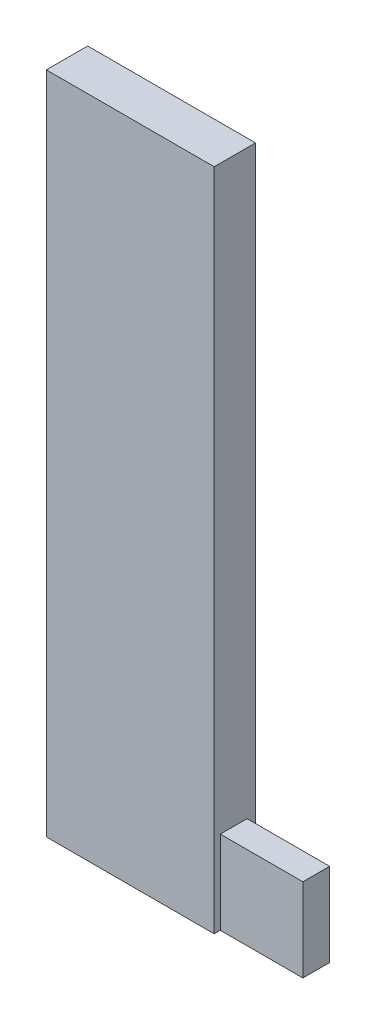
ISO-10303-21;
HEADER;
FILE_DESCRIPTION(('STEP AP214'),'2;1');
FILE_NAME('part.step','',(''),(''),'','','');
FILE_SCHEMA(('AUTOMOTIVE_DESIGN { 1 0 10303 214 1 1 1 1 }'));
ENDSEC;
DATA;
#1=APPLICATION_CONTEXT('core data for automotive mechanical design processes');
#2=APPLICATION_PROTOCOL_DEFINITION('international standard','automotive_design',2000,#1);
#3=PRODUCT_CONTEXT('',#1,'mechanical');
#4=PRODUCT('Part','Part','',(#3));
#5=PRODUCT_RELATED_PRODUCT_CATEGORY('part','',(#4));
#6=PRODUCT_DEFINITION_FORMATION('','',#4);
#7=PRODUCT_DEFINITION_CONTEXT('part definition',#1,'design');
#8=PRODUCT_DEFINITION('design','',#6,#7);
#9=PRODUCT_DEFINITION_SHAPE('','',#8);
#10=(LENGTH_UNIT() NAMED_UNIT(*) SI_UNIT(.MILLI.,.METRE.));
#11=(NAMED_UNIT(*) PLANE_ANGLE_UNIT() SI_UNIT($,.RADIAN.));
#12=(NAMED_UNIT(*) SI_UNIT($,.STERADIAN.) SOLID_ANGLE_UNIT());
#13=UNCERTAINTY_MEASURE_WITH_UNIT(LENGTH_MEASURE(1.E-05),#10,'distance_accuracy_value','');
#14=(GEOMETRIC_REPRESENTATION_CONTEXT(3) GLOBAL_UNCERTAINTY_ASSIGNED_CONTEXT((#13)) GLOBAL_UNIT_ASSIGNED_CONTEXT((#10,
#11,#12)) REPRESENTATION_CONTEXT('',''));
#15=CARTESIAN_POINT('',(0.,0.,0.));
#16=DIRECTION('',(0.,0.,1.));
#17=DIRECTION('',(1.,0.,0.));
#18=AXIS2_PLACEMENT_3D('',#15,#16,#17);
#19=CARTESIAN_POINT('',(-37.5648019739697,-2.3820263364277,1.27));
#20=DIRECTION('',(0.,1.,0.));
#21=DIRECTION('',(0.,0.,1.));
#22=AXIS2_PLACEMENT_3D('',#19,#20,#21);
#23=PLANE('',#22);
#24=DIRECTION('',(1.,0.,0.));
#25=VECTOR('',#24,1.);
#26=CARTESIAN_POINT('',(-37.5648019739697,-2.3820263364277,0.));
#27=LINE('',#26,#25);
#28=CARTESIAN_POINT('',(-37.5648019739697,-2.3820263364277,0.));
#29=VERTEX_POINT('',#28);
#30=CARTESIAN_POINT('',(-32.4024186657096,-2.3820263364277,0.));
#31=VERTEX_POINT('',#30);
#32=EDGE_CURVE('E191',#29,#31,#27,.T.);
#33=ORIENTED_EDGE('',*,*,#32,.T.);
#34=DIRECTION('',(0.,0.,-1.));
#35=VECTOR('',#34,1.);
#36=CARTESIAN_POINT('',(-32.4024186657096,-2.3820263364277,1.27));
#37=LINE('',#36,#35);
#38=CARTESIAN_POINT('',(-32.4024186657096,-2.3820263364277,0.259253936790594));
#39=VERTEX_POINT('',#38);
#40=EDGE_CURVE('E47',#39,#31,#37,.T.);
#41=ORIENTED_EDGE('',*,*,#40,.F.);
#42=DIRECTION('',(-1.,0.,0.));
#43=VECTOR('',#42,1.);
#44=CARTESIAN_POINT('',(-29.8624186657096,-2.3820263364277,0.259253936790594));
#45=LINE('',#44,#43);
#46=CARTESIAN_POINT('',(-29.8624186657096,-2.3820263364277,0.259253936790594));
#47=VERTEX_POINT('',#46);
#48=EDGE_CURVE('E130',#47,#39,#45,.T.);
#49=ORIENTED_EDGE('',*,*,#48,.F.);
#50=DIRECTION('',(0.,0.,-1.));
#51=VECTOR('',#50,1.);
#52=CARTESIAN_POINT('',(-29.8624186657096,-2.3820263364277,0.259253936790594));
#53=LINE('',#52,#51);
#54=CARTESIAN_POINT('',(-29.8624186657096,-2.3820263364277,1.0822686477362));
#55=VERTEX_POINT('',#54);
#56=EDGE_CURVE('E137',#55,#47,#53,.T.);
#57=ORIENTED_EDGE('',*,*,#56,.F.);
#58=DIRECTION('',(-1.,0.,0.));
#59=VECTOR('',#58,1.);
#60=CARTESIAN_POINT('',(-29.8624186657096,-2.3820263364277,1.0822686477362));
#61=LINE('',#60,#59);
#62=CARTESIAN_POINT('',(-32.4024186657096,-2.3820263364277,1.0822686477362));
#63=VERTEX_POINT('',#62);
#64=EDGE_CURVE('E259',#55,#63,#61,.T.);
#65=ORIENTED_EDGE('',*,*,#64,.T.);
#66=CARTESIAN_POINT('',(-32.4024186657096,-2.3820263364277,1.27));
#67=VERTEX_POINT('',#66);
#68=EDGE_CURVE('E11',#67,#63,#37,.T.);
#69=ORIENTED_EDGE('',*,*,#68,.F.);
#70=DIRECTION('',(1.,0.,0.));
#71=VECTOR('',#70,1.);
#72=CARTESIAN_POINT('',(-37.5648019739697,-2.3820263364277,1.27));
#73=LINE('',#72,#71);
#74=CARTESIAN_POINT('',(-37.5648019739697,-2.3820263364277,1.27));
#75=VERTEX_POINT('',#74);
#76=EDGE_CURVE('E201',#75,#67,#73,.T.);
#77=ORIENTED_EDGE('',*,*,#76,.F.);
#78=DIRECTION('',(0.,0.,-1.));
#79=VECTOR('',#78,1.);
#80=CARTESIAN_POINT('',(-37.5648019739697,-2.3820263364277,1.27));
#81=LINE('',#80,#79);
#82=EDGE_CURVE('E216',#75,#29,#81,.T.);
#83=ORIENTED_EDGE('',*,*,#82,.T.);
#84=EDGE_LOOP('',(#33,#41,#49,#57,#65,#69,#77,#83));
#85=FACE_BOUND('',#84,.T.);
#86=ADVANCED_FACE('F39',(#85),#23,.F.);
#87=CARTESIAN_POINT('',(-32.4024186657096,18.0530258479316,1.27));
#88=DIRECTION('',(1.,0.,0.));
#89=DIRECTION('',(0.,0.,-1.));
#90=AXIS2_PLACEMENT_3D('',#87,#88,#89);
#91=PLANE('',#90);
#92=DIRECTION('',(0.,-1.,0.));
#93=VECTOR('',#92,1.);
#94=CARTESIAN_POINT('',(-32.4024186657096,-2.3820263364277,1.0822686477362));
#95=LINE('',#94,#93);
#96=CARTESIAN_POINT('',(-32.4024186657096,0.181462943957815,1.0822686477362));
#97=VERTEX_POINT('',#96);
#98=EDGE_CURVE('E53',#97,#63,#95,.T.);
#99=ORIENTED_EDGE('',*,*,#98,.F.);
#100=DIRECTION('',(0.,0.,1.));
#101=VECTOR('',#100,1.);
#102=CARTESIAN_POINT('',(-32.4024186657096,0.181462943957815,1.0822686477362));
#103=LINE('',#102,#101);
#104=CARTESIAN_POINT('',(-32.4024186657096,0.181462943957815,0.259253936790594));
#105=VERTEX_POINT('',#104);
#106=EDGE_CURVE('E262',#105,#97,#103,.T.);
#107=ORIENTED_EDGE('',*,*,#106,.F.);
#108=DIRECTION('',(0.,1.,0.));
#109=VECTOR('',#108,1.);
#110=CARTESIAN_POINT('',(-32.4024186657096,0.181462943957815,0.259253936790594));
#111=LINE('',#110,#109);
#112=EDGE_CURVE('E59',#39,#105,#111,.T.);
#113=ORIENTED_EDGE('',*,*,#112,.F.);
#114=ORIENTED_EDGE('',*,*,#40,.T.);
#115=DIRECTION('',(0.,-1.,0.));
#116=VECTOR('',#115,1.);
#117=CARTESIAN_POINT('',(-32.4024186657096,18.0530258479316,0.));
#118=LINE('',#117,#116);
#119=CARTESIAN_POINT('',(-32.4024186657096,18.0530258479316,0.));
#120=VERTEX_POINT('',#119);
#121=EDGE_CURVE('E219',#120,#31,#118,.T.);
#122=ORIENTED_EDGE('',*,*,#121,.F.);
#123=DIRECTION('',(0.,0.,-1.));
#124=VECTOR('',#123,1.);
#125=CARTESIAN_POINT('',(-32.4024186657096,18.0530258479316,1.27));
#126=LINE('',#125,#124);
#127=CARTESIAN_POINT('',(-32.4024186657096,18.0530258479316,1.27));
#128=VERTEX_POINT('',#127);
#129=EDGE_CURVE('E234',#128,#120,#126,.T.);
#130=ORIENTED_EDGE('',*,*,#129,.F.);
#131=DIRECTION('',(0.,-1.,0.));
#132=VECTOR('',#131,1.);
#133=CARTESIAN_POINT('',(-32.4024186657096,18.0530258479316,1.27));
#134=LINE('',#133,#132);
#135=EDGE_CURVE('E204',#128,#67,#134,.T.);
#136=ORIENTED_EDGE('',*,*,#135,.T.);
#137=ORIENTED_EDGE('',*,*,#68,.T.);
#138=EDGE_LOOP('',(#99,#107,#113,#114,#122,#130,#136,#137));
#139=FACE_BOUND('',#138,.T.);
#140=ADVANCED_FACE('F240',(#139),#91,.T.);
#141=CARTESIAN_POINT('',(-37.5648019739697,18.0530258479316,1.27));
#142=DIRECTION('',(0.,1.,0.));
#143=DIRECTION('',(0.,0.,1.));
#144=AXIS2_PLACEMENT_3D('',#141,#142,#143);
#145=PLANE('',#144);
#146=DIRECTION('',(1.,0.,0.));
#147=VECTOR('',#146,1.);
#148=CARTESIAN_POINT('',(-37.5648019739697,18.0530258479316,0.));
#149=LINE('',#148,#147);
#150=CARTESIAN_POINT('',(-37.5648019739697,18.0530258479316,0.));
#151=VERTEX_POINT('',#150);
#152=EDGE_CURVE('E223',#151,#120,#149,.T.);
#153=ORIENTED_EDGE('',*,*,#152,.F.);
#154=DIRECTION('',(0.,0.,-1.));
#155=VECTOR('',#154,1.);
#156=CARTESIAN_POINT('',(-37.5648019739697,18.0530258479316,1.27));
#157=LINE('',#156,#155);
#158=CARTESIAN_POINT('',(-37.5648019739697,18.0530258479316,1.27));
#159=VERTEX_POINT('',#158);
#160=EDGE_CURVE('E232',#159,#151,#157,.T.);
#161=ORIENTED_EDGE('',*,*,#160,.F.);
#162=DIRECTION('',(1.,0.,0.));
#163=VECTOR('',#162,1.);
#164=CARTESIAN_POINT('',(-37.5648019739697,18.0530258479316,1.27));
#165=LINE('',#164,#163);
#166=EDGE_CURVE('E209',#159,#128,#165,.T.);
#167=ORIENTED_EDGE('',*,*,#166,.T.);
#168=ORIENTED_EDGE('',*,*,#129,.T.);
#169=EDGE_LOOP('',(#153,#161,#167,#168));
#170=FACE_BOUND('',#169,.T.);
#171=ADVANCED_FACE('F247',(#170),#145,.T.);
#172=CARTESIAN_POINT('',(-37.5648019739697,18.0530258479316,1.27));
#173=DIRECTION('',(1.,0.,0.));
#174=DIRECTION('',(0.,0.,-1.));
#175=AXIS2_PLACEMENT_3D('',#172,#173,#174);
#176=PLANE('',#175);
#177=DIRECTION('',(0.,0.,-1.));
#178=VECTOR('',#177,1.);
#179=CARTESIAN_POINT('',(-37.5648019739697,16.8739681908789,0.191724219646972));
#180=LINE('',#179,#178);
#181=CARTESIAN_POINT('',(-37.5648019739697,16.8739681908789,1.03065807070379));
#182=VERTEX_POINT('',#181);
#183=CARTESIAN_POINT('',(-37.5648019739697,16.8739681908789,0.191724219646972));
#184=VERTEX_POINT('',#183);
#185=EDGE_CURVE('E154',#182,#184,#180,.T.);
#186=ORIENTED_EDGE('',*,*,#185,.F.);
#187=DIRECTION('',(0.,1.,0.));
#188=VECTOR('',#187,1.);
#189=CARTESIAN_POINT('',(-37.5648019739697,16.8739681908789,1.03065807070379));
#190=LINE('',#189,#188);
#191=CARTESIAN_POINT('',(-37.5648019739697,12.9918277277312,1.03065807070379));
#192=VERTEX_POINT('',#191);
#193=EDGE_CURVE('E150',#192,#182,#190,.T.);
#194=ORIENTED_EDGE('',*,*,#193,.F.);
#195=DIRECTION('',(0.,0.,1.));
#196=VECTOR('',#195,1.);
#197=CARTESIAN_POINT('',(-37.5648019739697,12.9918277277312,0.191724219646972));
#198=LINE('',#197,#196);
#199=CARTESIAN_POINT('',(-37.5648019739697,12.9918277277312,0.191724219646972));
#200=VERTEX_POINT('',#199);
#201=EDGE_CURVE('E165',#200,#192,#198,.T.);
#202=ORIENTED_EDGE('',*,*,#201,.F.);
#203=DIRECTION('',(0.,-1.,0.));
#204=VECTOR('',#203,1.);
#205=CARTESIAN_POINT('',(-37.5648019739697,16.8739681908789,0.191724219646972));
#206=LINE('',#205,#204);
#207=EDGE_CURVE('E181',#184,#200,#206,.T.);
#208=ORIENTED_EDGE('',*,*,#207,.F.);
#209=EDGE_LOOP('',(#186,#194,#202,#208));
#210=FACE_BOUND('',#209,.T.);
#211=DIRECTION('',(0.,-1.,0.));
#212=VECTOR('',#211,1.);
#213=CARTESIAN_POINT('',(-37.5648019739697,18.0530258479316,0.));
#214=LINE('',#213,#212);
#215=EDGE_CURVE('E205',#151,#29,#214,.T.);
#216=ORIENTED_EDGE('',*,*,#215,.T.);
#217=ORIENTED_EDGE('',*,*,#82,.F.);
#218=DIRECTION('',(0.,-1.,0.));
#219=VECTOR('',#218,1.);
#220=CARTESIAN_POINT('',(-37.5648019739697,18.0530258479316,1.27));
#221=LINE('',#220,#219);
#222=EDGE_CURVE('E213',#159,#75,#221,.T.);
#223=ORIENTED_EDGE('',*,*,#222,.F.);
#224=ORIENTED_EDGE('',*,*,#160,.T.);
#225=EDGE_LOOP('',(#216,#217,#223,#224));
#226=FACE_BOUND('',#225,.T.);
#227=ADVANCED_FACE('F251',(#210,#226),#176,.F.);
#228=CARTESIAN_POINT('',(0.,0.,1.27));
#229=DIRECTION('',(0.,0.,-1.));
#230=DIRECTION('',(-1.,0.,0.));
#231=AXIS2_PLACEMENT_3D('',#228,#229,#230);
#232=PLANE('',#231);
#233=ORIENTED_EDGE('',*,*,#76,.T.);
#234=ORIENTED_EDGE('',*,*,#135,.F.);
#235=ORIENTED_EDGE('',*,*,#166,.F.);
#236=ORIENTED_EDGE('',*,*,#222,.T.);
#237=EDGE_LOOP('',(#233,#234,#235,#236));
#238=FACE_BOUND('',#237,.T.);
#239=ADVANCED_FACE('F254',(#238),#232,.F.);
#240=CARTESIAN_POINT('',(0.,0.,0.));
#241=DIRECTION('',(0.,0.,-1.));
#242=DIRECTION('',(-1.,0.,0.));
#243=AXIS2_PLACEMENT_3D('',#240,#241,#242);
#244=PLANE('',#243);
#245=ORIENTED_EDGE('',*,*,#32,.F.);
#246=ORIENTED_EDGE('',*,*,#215,.F.);
#247=ORIENTED_EDGE('',*,*,#152,.T.);
#248=ORIENTED_EDGE('',*,*,#121,.T.);
#249=EDGE_LOOP('',(#245,#246,#247,#248));
#250=FACE_BOUND('',#249,.T.);
#251=ADVANCED_FACE('F246',(#250),#244,.T.);
#252=CARTESIAN_POINT('',(-33.7548019739697,16.8739681908789,1.03065807070379));
#253=DIRECTION('',(0.,0.,1.));
#254=DIRECTION('',(1.,0.,0.));
#255=AXIS2_PLACEMENT_3D('',#252,#253,#254);
#256=PLANE('',#255);
#257=ORIENTED_EDGE('',*,*,#193,.T.);
#258=DIRECTION('',(-1.,0.,0.));
#259=VECTOR('',#258,1.);
#260=CARTESIAN_POINT('',(-33.7548019739697,16.8739681908789,1.03065807070379));
#261=LINE('',#260,#259);
#262=CARTESIAN_POINT('',(-33.7548019739697,16.8739681908789,1.03065807070379));
#263=VERTEX_POINT('',#262);
#264=EDGE_CURVE('E176',#263,#182,#261,.T.);
#265=ORIENTED_EDGE('',*,*,#264,.F.);
#266=DIRECTION('',(0.,1.,0.));
#267=VECTOR('',#266,1.);
#268=CARTESIAN_POINT('',(-33.7548019739697,16.8739681908789,1.03065807070379));
#269=LINE('',#268,#267);
#270=CARTESIAN_POINT('',(-33.7548019739697,12.9918277277312,1.03065807070379));
#271=VERTEX_POINT('',#270);
#272=EDGE_CURVE('E160',#271,#263,#269,.T.);
#273=ORIENTED_EDGE('',*,*,#272,.F.);
#274=DIRECTION('',(-1.,0.,0.));
#275=VECTOR('',#274,1.);
#276=CARTESIAN_POINT('',(-33.7548019739697,12.9918277277312,1.03065807070379));
#277=LINE('',#276,#275);
#278=EDGE_CURVE('E188',#271,#192,#277,.T.);
#279=ORIENTED_EDGE('',*,*,#278,.T.);
#280=EDGE_LOOP('',(#257,#265,#273,#279));
#281=FACE_BOUND('',#280,.T.);
#282=ADVANCED_FACE('F300',(#281),#256,.F.);
#283=CARTESIAN_POINT('',(-33.7548019739697,12.9918277277312,0.191724219646972));
#284=DIRECTION('',(0.,-1.,0.));
#285=DIRECTION('',(0.,0.,-1.));
#286=AXIS2_PLACEMENT_3D('',#283,#284,#285);
#287=PLANE('',#286);
#288=ORIENTED_EDGE('',*,*,#201,.T.);
#289=ORIENTED_EDGE('',*,*,#278,.F.);
#290=DIRECTION('',(0.,0.,1.));
#291=VECTOR('',#290,1.);
#292=CARTESIAN_POINT('',(-33.7548019739697,12.9918277277312,0.191724219646972));
#293=LINE('',#292,#291);
#294=CARTESIAN_POINT('',(-33.7548019739697,12.9918277277312,0.191724219646972));
#295=VERTEX_POINT('',#294);
#296=EDGE_CURVE('E173',#295,#271,#293,.T.);
#297=ORIENTED_EDGE('',*,*,#296,.F.);
#298=DIRECTION('',(-1.,0.,0.));
#299=VECTOR('',#298,1.);
#300=CARTESIAN_POINT('',(-33.7548019739697,12.9918277277312,0.191724219646972));
#301=LINE('',#300,#299);
#302=EDGE_CURVE('E192',#295,#200,#301,.T.);
#303=ORIENTED_EDGE('',*,*,#302,.T.);
#304=EDGE_LOOP('',(#288,#289,#297,#303));
#305=FACE_BOUND('',#304,.T.);
#306=ADVANCED_FACE('F305',(#305),#287,.F.);
#307=CARTESIAN_POINT('',(-33.7548019739697,16.8739681908789,0.191724219646972));
#308=DIRECTION('',(0.,0.,-1.));
#309=DIRECTION('',(-1.,0.,0.));
#310=AXIS2_PLACEMENT_3D('',#307,#308,#309);
#311=PLANE('',#310);
#312=ORIENTED_EDGE('',*,*,#207,.T.);
#313=ORIENTED_EDGE('',*,*,#302,.F.);
#314=DIRECTION('',(0.,-1.,0.));
#315=VECTOR('',#314,1.);
#316=CARTESIAN_POINT('',(-33.7548019739697,16.8739681908789,0.191724219646972));
#317=LINE('',#316,#315);
#318=CARTESIAN_POINT('',(-33.7548019739697,16.8739681908789,0.191724219646972));
#319=VERTEX_POINT('',#318);
#320=EDGE_CURVE('E169',#319,#295,#317,.T.);
#321=ORIENTED_EDGE('',*,*,#320,.F.);
#322=DIRECTION('',(-1.,0.,0.));
#323=VECTOR('',#322,1.);
#324=CARTESIAN_POINT('',(-33.7548019739697,16.8739681908789,0.191724219646972));
#325=LINE('',#324,#323);
#326=EDGE_CURVE('E195',#319,#184,#325,.T.);
#327=ORIENTED_EDGE('',*,*,#326,.T.);
#328=EDGE_LOOP('',(#312,#313,#321,#327));
#329=FACE_BOUND('',#328,.T.);
#330=ADVANCED_FACE('F310',(#329),#311,.F.);
#331=CARTESIAN_POINT('',(-33.7548019739697,16.8739681908789,0.191724219646972));
#332=DIRECTION('',(0.,1.,0.));
#333=DIRECTION('',(0.,0.,1.));
#334=AXIS2_PLACEMENT_3D('',#331,#332,#333);
#335=PLANE('',#334);
#336=ORIENTED_EDGE('',*,*,#185,.T.);
#337=ORIENTED_EDGE('',*,*,#326,.F.);
#338=DIRECTION('',(0.,0.,-1.));
#339=VECTOR('',#338,1.);
#340=CARTESIAN_POINT('',(-33.7548019739697,16.8739681908789,0.191724219646972));
#341=LINE('',#340,#339);
#342=EDGE_CURVE('E164',#263,#319,#341,.T.);
#343=ORIENTED_EDGE('',*,*,#342,.F.);
#344=ORIENTED_EDGE('',*,*,#264,.T.);
#345=EDGE_LOOP('',(#336,#337,#343,#344));
#346=FACE_BOUND('',#345,.T.);
#347=ADVANCED_FACE('F307',(#346),#335,.F.);
#348=CARTESIAN_POINT('',(-33.7548019739697,0.,0.));
#349=DIRECTION('',(-1.,0.,0.));
#350=DIRECTION('',(0.,0.,1.));
#351=AXIS2_PLACEMENT_3D('',#348,#349,#350);
#352=PLANE('',#351);
#353=ORIENTED_EDGE('',*,*,#272,.T.);
#354=ORIENTED_EDGE('',*,*,#342,.T.);
#355=ORIENTED_EDGE('',*,*,#320,.T.);
#356=ORIENTED_EDGE('',*,*,#296,.T.);
#357=EDGE_LOOP('',(#353,#354,#355,#356));
#358=FACE_BOUND('',#357,.T.);
#359=ADVANCED_FACE('F284',(#358),#352,.T.);
#360=CARTESIAN_POINT('',(-29.8624186657096,0.181462943957815,0.259253936790594));
#361=DIRECTION('',(0.,0.,1.));
#362=DIRECTION('',(1.,0.,0.));
#363=AXIS2_PLACEMENT_3D('',#360,#361,#362);
#364=PLANE('',#363);
#365=ORIENTED_EDGE('',*,*,#112,.T.);
#366=DIRECTION('',(-1.,0.,0.));
#367=VECTOR('',#366,1.);
#368=CARTESIAN_POINT('',(-29.8624186657096,0.181462943957815,0.259253936790594));
#369=LINE('',#368,#367);
#370=CARTESIAN_POINT('',(-29.8624186657096,0.181462943957815,0.259253936790594));
#371=VERTEX_POINT('',#370);
#372=EDGE_CURVE('E132',#371,#105,#369,.T.);
#373=ORIENTED_EDGE('',*,*,#372,.F.);
#374=DIRECTION('',(0.,1.,0.));
#375=VECTOR('',#374,1.);
#376=CARTESIAN_POINT('',(-29.8624186657096,0.181462943957815,0.259253936790594));
#377=LINE('',#376,#375);
#378=EDGE_CURVE('E126',#47,#371,#377,.T.);
#379=ORIENTED_EDGE('',*,*,#378,.F.);
#380=ORIENTED_EDGE('',*,*,#48,.T.);
#381=EDGE_LOOP('',(#365,#373,#379,#380));
#382=FACE_BOUND('',#381,.T.);
#383=ADVANCED_FACE('F128',(#382),#364,.F.);
#384=CARTESIAN_POINT('',(-29.8624186657096,0.181462943957815,1.0822686477362));
#385=DIRECTION('',(0.,-1.,0.));
#386=DIRECTION('',(0.,0.,-1.));
#387=AXIS2_PLACEMENT_3D('',#384,#385,#386);
#388=PLANE('',#387);
#389=ORIENTED_EDGE('',*,*,#106,.T.);
#390=DIRECTION('',(-1.,0.,0.));
#391=VECTOR('',#390,1.);
#392=CARTESIAN_POINT('',(-29.8624186657096,0.181462943957815,1.0822686477362));
#393=LINE('',#392,#391);
#394=CARTESIAN_POINT('',(-29.8624186657096,0.181462943957815,1.0822686477362));
#395=VERTEX_POINT('',#394);
#396=EDGE_CURVE('E156',#395,#97,#393,.T.);
#397=ORIENTED_EDGE('',*,*,#396,.F.);
#398=DIRECTION('',(0.,0.,1.));
#399=VECTOR('',#398,1.);
#400=CARTESIAN_POINT('',(-29.8624186657096,0.181462943957815,1.0822686477362));
#401=LINE('',#400,#399);
#402=EDGE_CURVE('E136',#371,#395,#401,.T.);
#403=ORIENTED_EDGE('',*,*,#402,.F.);
#404=ORIENTED_EDGE('',*,*,#372,.T.);
#405=EDGE_LOOP('',(#389,#397,#403,#404));
#406=FACE_BOUND('',#405,.T.);
#407=ADVANCED_FACE('F276',(#406),#388,.F.);
#408=CARTESIAN_POINT('',(-29.8624186657096,-2.3820263364277,1.0822686477362));
#409=DIRECTION('',(0.,0.,-1.));
#410=DIRECTION('',(-1.,0.,0.));
#411=AXIS2_PLACEMENT_3D('',#408,#409,#410);
#412=PLANE('',#411);
#413=ORIENTED_EDGE('',*,*,#98,.T.);
#414=ORIENTED_EDGE('',*,*,#64,.F.);
#415=DIRECTION('',(0.,-1.,0.));
#416=VECTOR('',#415,1.);
#417=CARTESIAN_POINT('',(-29.8624186657096,-2.3820263364277,1.0822686477362));
#418=LINE('',#417,#416);
#419=EDGE_CURVE('E142',#395,#55,#418,.T.);
#420=ORIENTED_EDGE('',*,*,#419,.F.);
#421=ORIENTED_EDGE('',*,*,#396,.T.);
#422=EDGE_LOOP('',(#413,#414,#420,#421));
#423=FACE_BOUND('',#422,.T.);
#424=ADVANCED_FACE('F258',(#423),#412,.F.);
#425=CARTESIAN_POINT('',(-29.8624186657096,0.,0.));
#426=DIRECTION('',(-1.,0.,0.));
#427=DIRECTION('',(0.,0.,1.));
#428=AXIS2_PLACEMENT_3D('',#425,#426,#427);
#429=PLANE('',#428);
#430=ORIENTED_EDGE('',*,*,#56,.T.);
#431=ORIENTED_EDGE('',*,*,#378,.T.);
#432=ORIENTED_EDGE('',*,*,#402,.T.);
#433=ORIENTED_EDGE('',*,*,#419,.T.);
#434=EDGE_LOOP('',(#430,#431,#432,#433));
#435=FACE_BOUND('',#434,.T.);
#436=ADVANCED_FACE('F140',(#435),#429,.F.);
#437=CLOSED_SHELL('',(#86,#140,#171,#227,#239,#251,#282,#306,#330,#347,#359,#383,#407,#424,#436));
#438=MANIFOLD_SOLID_BREP('B2',#437);
#439=ADVANCED_BREP_SHAPE_REPRESENTATION('',(#18,#438),#14);
#440=SHAPE_DEFINITION_REPRESENTATION(#9,#439);
ENDSEC;
END-ISO-10303-21;
